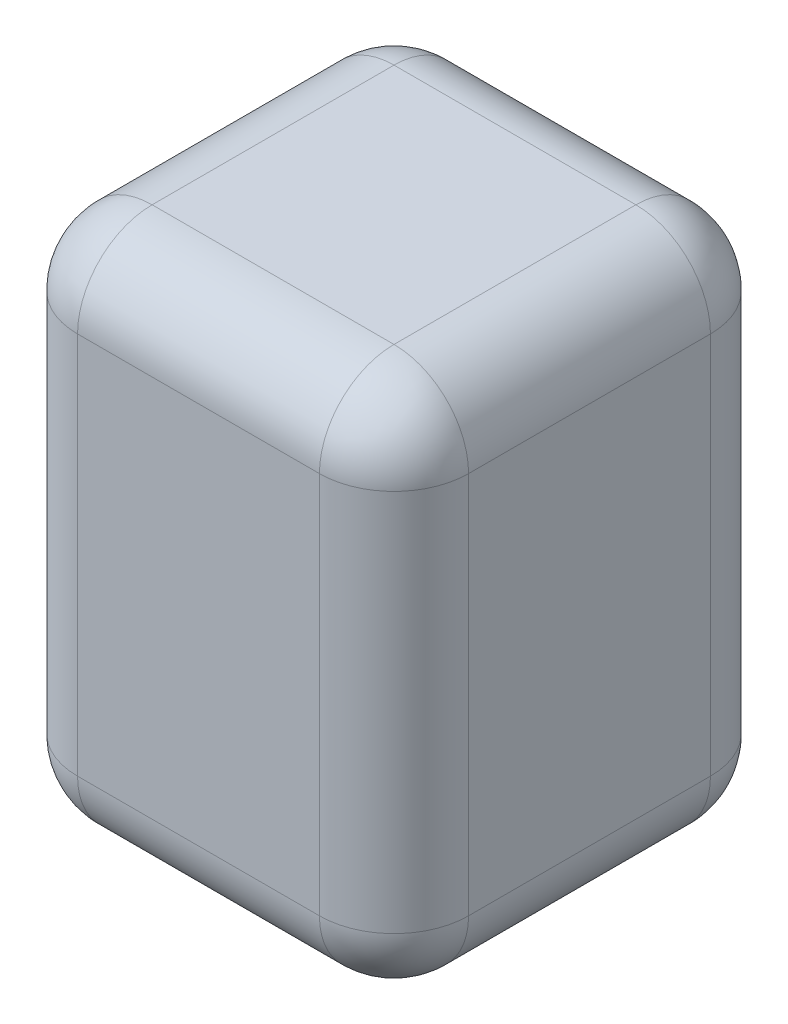
ISO-10303-21;
HEADER;
FILE_DESCRIPTION(('STEP AP214'),'2;1');
FILE_NAME('part.step','',(''),(''),'','','');
FILE_SCHEMA(('AUTOMOTIVE_DESIGN { 1 0 10303 214 1 1 1 1 }'));
ENDSEC;
DATA;
#1=APPLICATION_CONTEXT('core data for automotive mechanical design processes');
#2=APPLICATION_PROTOCOL_DEFINITION('international standard','automotive_design',2000,#1);
#3=PRODUCT_CONTEXT('',#1,'mechanical');
#4=PRODUCT('Part','Part','',(#3));
#5=PRODUCT_RELATED_PRODUCT_CATEGORY('part','',(#4));
#6=PRODUCT_DEFINITION_FORMATION('','',#4);
#7=PRODUCT_DEFINITION_CONTEXT('part definition',#1,'design');
#8=PRODUCT_DEFINITION('design','',#6,#7);
#9=PRODUCT_DEFINITION_SHAPE('','',#8);
#10=(LENGTH_UNIT() NAMED_UNIT(*) SI_UNIT(.MILLI.,.METRE.));
#11=(NAMED_UNIT(*) PLANE_ANGLE_UNIT() SI_UNIT($,.RADIAN.));
#12=(NAMED_UNIT(*) SI_UNIT($,.STERADIAN.) SOLID_ANGLE_UNIT());
#13=UNCERTAINTY_MEASURE_WITH_UNIT(LENGTH_MEASURE(1.E-05),#10,'distance_accuracy_value','');
#14=(GEOMETRIC_REPRESENTATION_CONTEXT(3) GLOBAL_UNCERTAINTY_ASSIGNED_CONTEXT((#13)) GLOBAL_UNIT_ASSIGNED_CONTEXT((#10,
#11,#12)) REPRESENTATION_CONTEXT('',''));
#15=CARTESIAN_POINT('',(0.,0.,0.));
#16=DIRECTION('',(0.,0.,1.));
#17=DIRECTION('',(1.,0.,0.));
#18=AXIS2_PLACEMENT_3D('',#15,#16,#17);
#19=CARTESIAN_POINT('',(-48.5,132.,-48.5));
#20=DIRECTION('',(1.,0.,0.));
#21=DIRECTION('',(0.,0.,-1.));
#22=AXIS2_PLACEMENT_3D('',#19,#20,#21);
#23=PLANE('',#22);
#24=DIRECTION('',(0.,-1.,0.));
#25=VECTOR('',#24,1.);
#26=CARTESIAN_POINT('',(-48.5,132.,-30.));
#27=LINE('',#26,#25);
#28=CARTESIAN_POINT('',(-48.5,113.5,-30.));
#29=VERTEX_POINT('',#28);
#30=CARTESIAN_POINT('',(-48.5,18.5,-30.));
#31=VERTEX_POINT('',#30);
#32=EDGE_CURVE('E176',#29,#31,#27,.T.);
#33=ORIENTED_EDGE('',*,*,#32,.T.);
#34=DIRECTION('',(0.,0.,1.));
#35=VECTOR('',#34,1.);
#36=CARTESIAN_POINT('',(-48.5,18.5,-48.5));
#37=LINE('',#36,#35);
#38=CARTESIAN_POINT('',(-48.5,18.5,30.));
#39=VERTEX_POINT('',#38);
#40=EDGE_CURVE('E185',#31,#39,#37,.T.);
#41=ORIENTED_EDGE('',*,*,#40,.T.);
#42=DIRECTION('',(0.,-1.,0.));
#43=VECTOR('',#42,1.);
#44=CARTESIAN_POINT('',(-48.5,132.,30.));
#45=LINE('',#44,#43);
#46=CARTESIAN_POINT('',(-48.5,113.5,30.));
#47=VERTEX_POINT('',#46);
#48=EDGE_CURVE('E140',#39,#47,#45,.F.);
#49=ORIENTED_EDGE('',*,*,#48,.T.);
#50=DIRECTION('',(0.,0.,1.));
#51=VECTOR('',#50,1.);
#52=CARTESIAN_POINT('',(-48.5,113.5,-48.5));
#53=LINE('',#52,#51);
#54=EDGE_CURVE('E172',#47,#29,#53,.F.);
#55=ORIENTED_EDGE('',*,*,#54,.T.);
#56=EDGE_LOOP('',(#33,#41,#49,#55));
#57=FACE_BOUND('',#56,.T.);
#58=ADVANCED_FACE('F44',(#57),#23,.F.);
#59=CARTESIAN_POINT('',(-48.5,132.,48.5));
#60=DIRECTION('',(0.,0.,-1.));
#61=DIRECTION('',(-1.,0.,0.));
#62=AXIS2_PLACEMENT_3D('',#59,#60,#61);
#63=PLANE('',#62);
#64=DIRECTION('',(1.,0.,0.));
#65=VECTOR('',#64,1.);
#66=CARTESIAN_POINT('',(-48.5,113.5,48.5));
#67=LINE('',#66,#65);
#68=CARTESIAN_POINT('',(30.,113.5,48.5));
#69=VERTEX_POINT('',#68);
#70=CARTESIAN_POINT('',(-30.,113.5,48.5));
#71=VERTEX_POINT('',#70);
#72=EDGE_CURVE('E169',#69,#71,#67,.F.);
#73=ORIENTED_EDGE('',*,*,#72,.T.);
#74=DIRECTION('',(0.,-1.,0.));
#75=VECTOR('',#74,1.);
#76=CARTESIAN_POINT('',(-30.,132.,48.5));
#77=LINE('',#76,#75);
#78=CARTESIAN_POINT('',(-30.,18.5,48.5));
#79=VERTEX_POINT('',#78);
#80=EDGE_CURVE('E138',#71,#79,#77,.T.);
#81=ORIENTED_EDGE('',*,*,#80,.T.);
#82=DIRECTION('',(1.,0.,0.));
#83=VECTOR('',#82,1.);
#84=CARTESIAN_POINT('',(-48.5,18.5,48.5));
#85=LINE('',#84,#83);
#86=CARTESIAN_POINT('',(30.,18.5,48.5));
#87=VERTEX_POINT('',#86);
#88=EDGE_CURVE('E158',#79,#87,#85,.T.);
#89=ORIENTED_EDGE('',*,*,#88,.T.);
#90=DIRECTION('',(0.,-1.,0.));
#91=VECTOR('',#90,1.);
#92=CARTESIAN_POINT('',(30.,132.,48.5));
#93=LINE('',#92,#91);
#94=EDGE_CURVE('E165',#87,#69,#93,.F.);
#95=ORIENTED_EDGE('',*,*,#94,.T.);
#96=EDGE_LOOP('',(#73,#81,#89,#95));
#97=FACE_BOUND('',#96,.T.);
#98=ADVANCED_FACE('F167',(#97),#63,.F.);
#99=CARTESIAN_POINT('',(48.5,132.,-48.5));
#100=DIRECTION('',(-1.,0.,0.));
#101=DIRECTION('',(0.,0.,1.));
#102=AXIS2_PLACEMENT_3D('',#99,#100,#101);
#103=PLANE('',#102);
#104=DIRECTION('',(0.,-1.,0.));
#105=VECTOR('',#104,1.);
#106=CARTESIAN_POINT('',(48.5,132.,30.));
#107=LINE('',#106,#105);
#108=CARTESIAN_POINT('',(48.5,113.5,30.));
#109=VERTEX_POINT('',#108);
#110=CARTESIAN_POINT('',(48.5,18.5,30.));
#111=VERTEX_POINT('',#110);
#112=EDGE_CURVE('E207',#109,#111,#107,.T.);
#113=ORIENTED_EDGE('',*,*,#112,.T.);
#114=DIRECTION('',(0.,0.,-1.));
#115=VECTOR('',#114,1.);
#116=CARTESIAN_POINT('',(48.5,18.5,-48.5));
#117=LINE('',#116,#115);
#118=CARTESIAN_POINT('',(48.5,18.5,-30.));
#119=VERTEX_POINT('',#118);
#120=EDGE_CURVE('E211',#111,#119,#117,.T.);
#121=ORIENTED_EDGE('',*,*,#120,.T.);
#122=DIRECTION('',(0.,-1.,0.));
#123=VECTOR('',#122,1.);
#124=CARTESIAN_POINT('',(48.5,132.,-30.));
#125=LINE('',#124,#123);
#126=CARTESIAN_POINT('',(48.5,113.5,-30.));
#127=VERTEX_POINT('',#126);
#128=EDGE_CURVE('E204',#119,#127,#125,.F.);
#129=ORIENTED_EDGE('',*,*,#128,.T.);
#130=DIRECTION('',(0.,0.,-1.));
#131=VECTOR('',#130,1.);
#132=CARTESIAN_POINT('',(48.5,113.5,48.5));
#133=LINE('',#132,#131);
#134=EDGE_CURVE('E201',#127,#109,#133,.F.);
#135=ORIENTED_EDGE('',*,*,#134,.T.);
#136=EDGE_LOOP('',(#113,#121,#129,#135));
#137=FACE_BOUND('',#136,.T.);
#138=ADVANCED_FACE('F337',(#137),#103,.F.);
#139=CARTESIAN_POINT('',(-48.5,132.,-48.5));
#140=DIRECTION('',(0.,0.,1.));
#141=DIRECTION('',(1.,0.,0.));
#142=AXIS2_PLACEMENT_3D('',#139,#140,#141);
#143=PLANE('',#142);
#144=DIRECTION('',(-1.,0.,0.));
#145=VECTOR('',#144,1.);
#146=CARTESIAN_POINT('',(48.5,113.5,-48.5));
#147=LINE('',#146,#145);
#148=CARTESIAN_POINT('',(-30.,113.5,-48.5));
#149=VERTEX_POINT('',#148);
#150=CARTESIAN_POINT('',(30.,113.5,-48.5));
#151=VERTEX_POINT('',#150);
#152=EDGE_CURVE('E54',#149,#151,#147,.F.);
#153=ORIENTED_EDGE('',*,*,#152,.T.);
#154=DIRECTION('',(0.,-1.,0.));
#155=VECTOR('',#154,1.);
#156=CARTESIAN_POINT('',(30.,132.,-48.5));
#157=LINE('',#156,#155);
#158=CARTESIAN_POINT('',(30.,18.5,-48.5));
#159=VERTEX_POINT('',#158);
#160=EDGE_CURVE('E11',#151,#159,#157,.T.);
#161=ORIENTED_EDGE('',*,*,#160,.T.);
#162=DIRECTION('',(-1.,0.,0.));
#163=VECTOR('',#162,1.);
#164=CARTESIAN_POINT('',(-48.5,18.5,-48.5));
#165=LINE('',#164,#163);
#166=CARTESIAN_POINT('',(-30.,18.5,-48.5));
#167=VERTEX_POINT('',#166);
#168=EDGE_CURVE('E227',#159,#167,#165,.T.);
#169=ORIENTED_EDGE('',*,*,#168,.T.);
#170=DIRECTION('',(0.,-1.,0.));
#171=VECTOR('',#170,1.);
#172=CARTESIAN_POINT('',(-30.,132.,-48.5));
#173=LINE('',#172,#171);
#174=EDGE_CURVE('E65',#167,#149,#173,.F.);
#175=ORIENTED_EDGE('',*,*,#174,.T.);
#176=EDGE_LOOP('',(#153,#161,#169,#175));
#177=FACE_BOUND('',#176,.T.);
#178=ADVANCED_FACE('F349',(#177),#143,.F.);
#179=CARTESIAN_POINT('',(0.,132.,0.));
#180=DIRECTION('',(0.,1.,0.));
#181=DIRECTION('',(0.,0.,1.));
#182=AXIS2_PLACEMENT_3D('',#179,#180,#181);
#183=PLANE('',#182);
#184=DIRECTION('',(1.,0.,0.));
#185=VECTOR('',#184,1.);
#186=CARTESIAN_POINT('',(48.5,132.,30.));
#187=LINE('',#186,#185);
#188=CARTESIAN_POINT('',(-30.,132.,30.));
#189=VERTEX_POINT('',#188);
#190=CARTESIAN_POINT('',(30.,132.,30.));
#191=VERTEX_POINT('',#190);
#192=EDGE_CURVE('E194',#189,#191,#187,.T.);
#193=ORIENTED_EDGE('',*,*,#192,.T.);
#194=DIRECTION('',(0.,0.,-1.));
#195=VECTOR('',#194,1.);
#196=CARTESIAN_POINT('',(30.,132.,-48.5));
#197=LINE('',#196,#195);
#198=CARTESIAN_POINT('',(30.,132.,-30.));
#199=VERTEX_POINT('',#198);
#200=EDGE_CURVE('E198',#191,#199,#197,.T.);
#201=ORIENTED_EDGE('',*,*,#200,.T.);
#202=DIRECTION('',(-1.,0.,0.));
#203=VECTOR('',#202,1.);
#204=CARTESIAN_POINT('',(-48.5,132.,-30.));
#205=LINE('',#204,#203);
#206=CARTESIAN_POINT('',(-30.,132.,-30.));
#207=VERTEX_POINT('',#206);
#208=EDGE_CURVE('E191',#199,#207,#205,.T.);
#209=ORIENTED_EDGE('',*,*,#208,.T.);
#210=DIRECTION('',(0.,0.,1.));
#211=VECTOR('',#210,1.);
#212=CARTESIAN_POINT('',(-30.,132.,48.5));
#213=LINE('',#212,#211);
#214=EDGE_CURVE('E188',#207,#189,#213,.T.);
#215=ORIENTED_EDGE('',*,*,#214,.T.);
#216=EDGE_LOOP('',(#193,#201,#209,#215));
#217=FACE_BOUND('',#216,.T.);
#218=ADVANCED_FACE('F328',(#217),#183,.T.);
#219=CARTESIAN_POINT('',(0.,0.,0.));
#220=DIRECTION('',(0.,1.,0.));
#221=DIRECTION('',(0.,0.,1.));
#222=AXIS2_PLACEMENT_3D('',#219,#220,#221);
#223=PLANE('',#222);
#224=DIRECTION('',(-1.,0.,0.));
#225=VECTOR('',#224,1.);
#226=CARTESIAN_POINT('',(0.,0.,-30.));
#227=LINE('',#226,#225);
#228=CARTESIAN_POINT('',(-30.,0.,-30.));
#229=VERTEX_POINT('',#228);
#230=CARTESIAN_POINT('',(30.,0.,-30.));
#231=VERTEX_POINT('',#230);
#232=EDGE_CURVE('E217',#229,#231,#227,.F.);
#233=ORIENTED_EDGE('',*,*,#232,.T.);
#234=DIRECTION('',(0.,0.,-1.));
#235=VECTOR('',#234,1.);
#236=CARTESIAN_POINT('',(30.,0.,0.));
#237=LINE('',#236,#235);
#238=CARTESIAN_POINT('',(30.,0.,30.));
#239=VERTEX_POINT('',#238);
#240=EDGE_CURVE('E224',#231,#239,#237,.F.);
#241=ORIENTED_EDGE('',*,*,#240,.T.);
#242=DIRECTION('',(1.,0.,0.));
#243=VECTOR('',#242,1.);
#244=CARTESIAN_POINT('',(0.,0.,30.));
#245=LINE('',#244,#243);
#246=CARTESIAN_POINT('',(-30.,0.,30.));
#247=VERTEX_POINT('',#246);
#248=EDGE_CURVE('E220',#239,#247,#245,.F.);
#249=ORIENTED_EDGE('',*,*,#248,.T.);
#250=DIRECTION('',(0.,0.,1.));
#251=VECTOR('',#250,1.);
#252=CARTESIAN_POINT('',(-30.,0.,0.));
#253=LINE('',#252,#251);
#254=EDGE_CURVE('E214',#247,#229,#253,.F.);
#255=ORIENTED_EDGE('',*,*,#254,.T.);
#256=EDGE_LOOP('',(#233,#241,#249,#255));
#257=FACE_BOUND('',#256,.T.);
#258=ADVANCED_FACE('F574',(#257),#223,.F.);
#259=CARTESIAN_POINT('',(30.,132.,-30.));
#260=DIRECTION('',(0.,-1.,0.));
#261=DIRECTION('',(0.,0.,-1.));
#262=AXIS2_PLACEMENT_3D('',#259,#260,#261);
#263=CYLINDRICAL_SURFACE('',#262,18.5);
#264=CARTESIAN_POINT('',(30.,113.5,-30.));
#265=DIRECTION('',(0.,1.,0.));
#266=DIRECTION('',(0.,0.,1.));
#267=AXIS2_PLACEMENT_3D('',#264,#265,#266);
#268=CIRCLE('',#267,18.5);
#269=EDGE_CURVE('E48',#127,#151,#268,.T.);
#270=ORIENTED_EDGE('',*,*,#269,.F.);
#271=ORIENTED_EDGE('',*,*,#128,.F.);
#272=CARTESIAN_POINT('',(30.,18.5,-30.));
#273=DIRECTION('',(0.,-1.,0.));
#274=DIRECTION('',(0.,0.,-1.));
#275=AXIS2_PLACEMENT_3D('',#272,#273,#274);
#276=CIRCLE('',#275,18.5);
#277=EDGE_CURVE('E304',#159,#119,#276,.T.);
#278=ORIENTED_EDGE('',*,*,#277,.F.);
#279=ORIENTED_EDGE('',*,*,#160,.F.);
#280=EDGE_LOOP('',(#270,#271,#278,#279));
#281=FACE_BOUND('',#280,.T.);
#282=ADVANCED_FACE('F46',(#281),#263,.T.);
#283=CARTESIAN_POINT('',(30.,113.5,-30.));
#284=DIRECTION('',(0.,0.,-1.));
#285=DIRECTION('',(-1.,0.,0.));
#286=AXIS2_PLACEMENT_3D('',#283,#284,#285);
#287=SPHERICAL_SURFACE('',#286,18.5);
#288=CARTESIAN_POINT('',(30.,113.5,-30.));
#289=DIRECTION('',(0.,0.,-1.));
#290=DIRECTION('',(-1.,0.,0.));
#291=AXIS2_PLACEMENT_3D('',#288,#289,#290);
#292=CIRCLE('',#291,18.5);
#293=EDGE_CURVE('E297',#127,#199,#292,.F.);
#294=ORIENTED_EDGE('',*,*,#293,.F.);
#295=ORIENTED_EDGE('',*,*,#269,.T.);
#296=CARTESIAN_POINT('',(30.,113.5,-30.));
#297=DIRECTION('',(1.,0.,0.));
#298=DIRECTION('',(0.,1.,0.));
#299=AXIS2_PLACEMENT_3D('',#296,#297,#298);
#300=CIRCLE('',#299,18.5);
#301=EDGE_CURVE('E301',#199,#151,#300,.F.);
#302=ORIENTED_EDGE('',*,*,#301,.F.);
#303=EDGE_LOOP('',(#294,#295,#302));
#304=FACE_BOUND('',#303,.T.);
#305=ADVANCED_FACE('F317',(#304),#287,.T.);
#306=CARTESIAN_POINT('',(30.,18.5,-30.));
#307=DIRECTION('',(1.,0.,0.));
#308=DIRECTION('',(0.,0.,-1.));
#309=AXIS2_PLACEMENT_3D('',#306,#307,#308);
#310=SPHERICAL_SURFACE('',#309,18.5);
#311=CARTESIAN_POINT('',(30.,18.5,-30.));
#312=DIRECTION('',(1.,0.,0.));
#313=DIRECTION('',(0.,0.,-1.));
#314=AXIS2_PLACEMENT_3D('',#311,#312,#313);
#315=CIRCLE('',#314,18.5);
#316=EDGE_CURVE('E289',#159,#231,#315,.F.);
#317=ORIENTED_EDGE('',*,*,#316,.F.);
#318=ORIENTED_EDGE('',*,*,#277,.T.);
#319=CARTESIAN_POINT('',(30.,18.5,-30.));
#320=DIRECTION('',(0.,0.,-1.));
#321=DIRECTION('',(-1.,0.,0.));
#322=AXIS2_PLACEMENT_3D('',#319,#320,#321);
#323=CIRCLE('',#322,18.5);
#324=EDGE_CURVE('E293',#231,#119,#323,.F.);
#325=ORIENTED_EDGE('',*,*,#324,.F.);
#326=EDGE_LOOP('',(#317,#318,#325));
#327=FACE_BOUND('',#326,.T.);
#328=ADVANCED_FACE('F547',(#327),#310,.T.);
#329=CARTESIAN_POINT('',(0.,113.5,-30.));
#330=DIRECTION('',(1.,0.,0.));
#331=DIRECTION('',(0.,0.,-1.));
#332=AXIS2_PLACEMENT_3D('',#329,#330,#331);
#333=CYLINDRICAL_SURFACE('',#332,18.5);
#334=ORIENTED_EDGE('',*,*,#301,.T.);
#335=ORIENTED_EDGE('',*,*,#152,.F.);
#336=CARTESIAN_POINT('',(-30.,113.5,-30.));
#337=DIRECTION('',(-1.,0.,0.));
#338=DIRECTION('',(0.,0.,1.));
#339=AXIS2_PLACEMENT_3D('',#336,#337,#338);
#340=CIRCLE('',#339,18.5);
#341=EDGE_CURVE('E281',#207,#149,#340,.T.);
#342=ORIENTED_EDGE('',*,*,#341,.F.);
#343=ORIENTED_EDGE('',*,*,#208,.F.);
#344=EDGE_LOOP('',(#334,#335,#342,#343));
#345=FACE_BOUND('',#344,.T.);
#346=ADVANCED_FACE('F323',(#345),#333,.T.);
#347=CARTESIAN_POINT('',(30.,113.5,0.));
#348=DIRECTION('',(0.,0.,1.));
#349=DIRECTION('',(1.,0.,0.));
#350=AXIS2_PLACEMENT_3D('',#347,#348,#349);
#351=CYLINDRICAL_SURFACE('',#350,18.5);
#352=ORIENTED_EDGE('',*,*,#293,.T.);
#353=ORIENTED_EDGE('',*,*,#200,.F.);
#354=CARTESIAN_POINT('',(30.,113.5,30.));
#355=DIRECTION('',(0.,0.,1.));
#356=DIRECTION('',(1.,0.,0.));
#357=AXIS2_PLACEMENT_3D('',#354,#355,#356);
#358=CIRCLE('',#357,18.5);
#359=EDGE_CURVE('E277',#109,#191,#358,.T.);
#360=ORIENTED_EDGE('',*,*,#359,.F.);
#361=ORIENTED_EDGE('',*,*,#134,.F.);
#362=EDGE_LOOP('',(#352,#353,#360,#361));
#363=FACE_BOUND('',#362,.T.);
#364=ADVANCED_FACE('F334',(#363),#351,.T.);
#365=CARTESIAN_POINT('',(30.,132.,30.));
#366=DIRECTION('',(0.,-1.,0.));
#367=DIRECTION('',(0.,0.,-1.));
#368=AXIS2_PLACEMENT_3D('',#365,#366,#367);
#369=CYLINDRICAL_SURFACE('',#368,18.5);
#370=CARTESIAN_POINT('',(30.,18.5,30.));
#371=DIRECTION('',(0.,-1.,0.));
#372=DIRECTION('',(0.,0.,-1.));
#373=AXIS2_PLACEMENT_3D('',#370,#371,#372);
#374=CIRCLE('',#373,18.5);
#375=EDGE_CURVE('E269',#111,#87,#374,.T.);
#376=ORIENTED_EDGE('',*,*,#375,.F.);
#377=ORIENTED_EDGE('',*,*,#112,.F.);
#378=CARTESIAN_POINT('',(30.,113.5,30.));
#379=DIRECTION('',(0.,1.,0.));
#380=DIRECTION('',(0.,0.,1.));
#381=AXIS2_PLACEMENT_3D('',#378,#379,#380);
#382=CIRCLE('',#381,18.5);
#383=EDGE_CURVE('E273',#69,#109,#382,.T.);
#384=ORIENTED_EDGE('',*,*,#383,.F.);
#385=ORIENTED_EDGE('',*,*,#94,.F.);
#386=EDGE_LOOP('',(#376,#377,#384,#385));
#387=FACE_BOUND('',#386,.T.);
#388=ADVANCED_FACE('F341',(#387),#369,.T.);
#389=CARTESIAN_POINT('',(30.,18.5,-48.5));
#390=DIRECTION('',(0.,0.,-1.));
#391=DIRECTION('',(-1.,0.,0.));
#392=AXIS2_PLACEMENT_3D('',#389,#390,#391);
#393=CYLINDRICAL_SURFACE('',#392,18.5);
#394=ORIENTED_EDGE('',*,*,#324,.T.);
#395=ORIENTED_EDGE('',*,*,#120,.F.);
#396=CARTESIAN_POINT('',(30.,18.5,30.));
#397=DIRECTION('',(0.,0.,1.));
#398=DIRECTION('',(1.,0.,0.));
#399=AXIS2_PLACEMENT_3D('',#396,#397,#398);
#400=CIRCLE('',#399,18.5);
#401=EDGE_CURVE('E266',#239,#111,#400,.T.);
#402=ORIENTED_EDGE('',*,*,#401,.F.);
#403=ORIENTED_EDGE('',*,*,#240,.F.);
#404=EDGE_LOOP('',(#394,#395,#402,#403));
#405=FACE_BOUND('',#404,.T.);
#406=ADVANCED_FACE('F347',(#405),#393,.T.);
#407=CARTESIAN_POINT('',(-48.5,18.5,-30.));
#408=DIRECTION('',(-1.,0.,0.));
#409=DIRECTION('',(0.,0.,1.));
#410=AXIS2_PLACEMENT_3D('',#407,#408,#409);
#411=CYLINDRICAL_SURFACE('',#410,18.5);
#412=ORIENTED_EDGE('',*,*,#316,.T.);
#413=ORIENTED_EDGE('',*,*,#232,.F.);
#414=CARTESIAN_POINT('',(-30.,18.5,-30.));
#415=DIRECTION('',(-1.,0.,0.));
#416=DIRECTION('',(0.,0.,1.));
#417=AXIS2_PLACEMENT_3D('',#414,#415,#416);
#418=CIRCLE('',#417,18.5);
#419=EDGE_CURVE('E262',#167,#229,#418,.T.);
#420=ORIENTED_EDGE('',*,*,#419,.F.);
#421=ORIENTED_EDGE('',*,*,#168,.F.);
#422=EDGE_LOOP('',(#412,#413,#420,#421));
#423=FACE_BOUND('',#422,.T.);
#424=ADVANCED_FACE('F358',(#423),#411,.T.);
#425=CARTESIAN_POINT('',(-30.,132.,-30.));
#426=DIRECTION('',(0.,-1.,0.));
#427=DIRECTION('',(0.,0.,-1.));
#428=AXIS2_PLACEMENT_3D('',#425,#426,#427);
#429=CYLINDRICAL_SURFACE('',#428,18.5);
#430=CARTESIAN_POINT('',(-30.,113.5,-30.));
#431=DIRECTION('',(0.,1.,0.));
#432=DIRECTION('',(0.,0.,1.));
#433=AXIS2_PLACEMENT_3D('',#430,#431,#432);
#434=CIRCLE('',#433,18.5);
#435=EDGE_CURVE('E285',#149,#29,#434,.T.);
#436=ORIENTED_EDGE('',*,*,#435,.F.);
#437=ORIENTED_EDGE('',*,*,#174,.F.);
#438=CARTESIAN_POINT('',(-30.,18.5,-30.));
#439=DIRECTION('',(0.,-1.,0.));
#440=DIRECTION('',(0.,0.,-1.));
#441=AXIS2_PLACEMENT_3D('',#438,#439,#440);
#442=CIRCLE('',#441,18.5);
#443=EDGE_CURVE('E258',#31,#167,#442,.T.);
#444=ORIENTED_EDGE('',*,*,#443,.F.);
#445=ORIENTED_EDGE('',*,*,#32,.F.);
#446=EDGE_LOOP('',(#436,#437,#444,#445));
#447=FACE_BOUND('',#446,.T.);
#448=ADVANCED_FACE('F354',(#447),#429,.T.);
#449=CARTESIAN_POINT('',(-30.,113.5,-30.));
#450=DIRECTION('',(0.,0.,-1.));
#451=DIRECTION('',(-1.,0.,0.));
#452=AXIS2_PLACEMENT_3D('',#449,#450,#451);
#453=SPHERICAL_SURFACE('',#452,18.5);
#454=ORIENTED_EDGE('',*,*,#341,.T.);
#455=ORIENTED_EDGE('',*,*,#435,.T.);
#456=CARTESIAN_POINT('',(-30.,113.5,-30.));
#457=DIRECTION('',(0.,0.,-1.));
#458=DIRECTION('',(-1.,0.,0.));
#459=AXIS2_PLACEMENT_3D('',#456,#457,#458);
#460=CIRCLE('',#459,18.5);
#461=EDGE_CURVE('E254',#207,#29,#460,.F.);
#462=ORIENTED_EDGE('',*,*,#461,.F.);
#463=EDGE_LOOP('',(#454,#455,#462));
#464=FACE_BOUND('',#463,.T.);
#465=ADVANCED_FACE('F367',(#464),#453,.T.);
#466=CARTESIAN_POINT('',(30.,113.5,30.));
#467=DIRECTION('',(1.,0.,0.));
#468=DIRECTION('',(0.,0.,-1.));
#469=AXIS2_PLACEMENT_3D('',#466,#467,#468);
#470=SPHERICAL_SURFACE('',#469,18.5);
#471=ORIENTED_EDGE('',*,*,#383,.T.);
#472=ORIENTED_EDGE('',*,*,#359,.T.);
#473=CARTESIAN_POINT('',(30.,113.5,30.));
#474=DIRECTION('',(1.,0.,0.));
#475=DIRECTION('',(0.,0.,-1.));
#476=AXIS2_PLACEMENT_3D('',#473,#474,#475);
#477=CIRCLE('',#476,18.5);
#478=EDGE_CURVE('E251',#69,#191,#477,.F.);
#479=ORIENTED_EDGE('',*,*,#478,.F.);
#480=EDGE_LOOP('',(#471,#472,#479));
#481=FACE_BOUND('',#480,.T.);
#482=ADVANCED_FACE('F377',(#481),#470,.T.);
#483=CARTESIAN_POINT('',(30.,18.5,30.));
#484=DIRECTION('',(1.,0.,0.));
#485=DIRECTION('',(0.,0.,-1.));
#486=AXIS2_PLACEMENT_3D('',#483,#484,#485);
#487=SPHERICAL_SURFACE('',#486,18.5);
#488=ORIENTED_EDGE('',*,*,#401,.T.);
#489=ORIENTED_EDGE('',*,*,#375,.T.);
#490=CARTESIAN_POINT('',(30.,18.5,30.));
#491=DIRECTION('',(1.,0.,0.));
#492=DIRECTION('',(0.,0.,-1.));
#493=AXIS2_PLACEMENT_3D('',#490,#491,#492);
#494=CIRCLE('',#493,18.5);
#495=EDGE_CURVE('E161',#239,#87,#494,.F.);
#496=ORIENTED_EDGE('',*,*,#495,.F.);
#497=EDGE_LOOP('',(#488,#489,#496));
#498=FACE_BOUND('',#497,.T.);
#499=ADVANCED_FACE('F379',(#498),#487,.T.);
#500=CARTESIAN_POINT('',(-30.,18.5,-30.));
#501=DIRECTION('',(0.,0.,-1.));
#502=DIRECTION('',(0.,1.,0.));
#503=AXIS2_PLACEMENT_3D('',#500,#501,#502);
#504=SPHERICAL_SURFACE('',#503,18.5);
#505=ORIENTED_EDGE('',*,*,#443,.T.);
#506=ORIENTED_EDGE('',*,*,#419,.T.);
#507=CARTESIAN_POINT('',(-30.,18.5,-30.));
#508=DIRECTION('',(0.,0.,-1.));
#509=DIRECTION('',(-1.,0.,0.));
#510=AXIS2_PLACEMENT_3D('',#507,#508,#509);
#511=CIRCLE('',#510,18.5);
#512=EDGE_CURVE('E245',#31,#229,#511,.F.);
#513=ORIENTED_EDGE('',*,*,#512,.F.);
#514=EDGE_LOOP('',(#505,#506,#513));
#515=FACE_BOUND('',#514,.T.);
#516=ADVANCED_FACE('F360',(#515),#504,.T.);
#517=CARTESIAN_POINT('',(-30.,113.5,0.));
#518=DIRECTION('',(0.,0.,-1.));
#519=DIRECTION('',(-1.,0.,0.));
#520=AXIS2_PLACEMENT_3D('',#517,#518,#519);
#521=CYLINDRICAL_SURFACE('',#520,18.5);
#522=ORIENTED_EDGE('',*,*,#461,.T.);
#523=ORIENTED_EDGE('',*,*,#54,.F.);
#524=CARTESIAN_POINT('',(-30.,113.5,30.));
#525=DIRECTION('',(0.,0.,1.));
#526=DIRECTION('',(1.,0.,0.));
#527=AXIS2_PLACEMENT_3D('',#524,#525,#526);
#528=CIRCLE('',#527,18.5);
#529=EDGE_CURVE('E241',#189,#47,#528,.T.);
#530=ORIENTED_EDGE('',*,*,#529,.F.);
#531=ORIENTED_EDGE('',*,*,#214,.F.);
#532=EDGE_LOOP('',(#522,#523,#530,#531));
#533=FACE_BOUND('',#532,.T.);
#534=ADVANCED_FACE('F369',(#533),#521,.T.);
#535=CARTESIAN_POINT('',(0.,113.5,30.));
#536=DIRECTION('',(-1.,0.,0.));
#537=DIRECTION('',(0.,0.,1.));
#538=AXIS2_PLACEMENT_3D('',#535,#536,#537);
#539=CYLINDRICAL_SURFACE('',#538,18.5);
#540=ORIENTED_EDGE('',*,*,#478,.T.);
#541=ORIENTED_EDGE('',*,*,#192,.F.);
#542=CARTESIAN_POINT('',(-30.,113.5,30.));
#543=DIRECTION('',(-1.,0.,0.));
#544=DIRECTION('',(0.,0.,1.));
#545=AXIS2_PLACEMENT_3D('',#542,#543,#544);
#546=CIRCLE('',#545,18.5);
#547=EDGE_CURVE('E155',#71,#189,#546,.T.);
#548=ORIENTED_EDGE('',*,*,#547,.F.);
#549=ORIENTED_EDGE('',*,*,#72,.F.);
#550=EDGE_LOOP('',(#540,#541,#548,#549));
#551=FACE_BOUND('',#550,.T.);
#552=ADVANCED_FACE('F375',(#551),#539,.T.);
#553=CARTESIAN_POINT('',(-48.5,18.5,30.));
#554=DIRECTION('',(1.,0.,0.));
#555=DIRECTION('',(0.,0.,-1.));
#556=AXIS2_PLACEMENT_3D('',#553,#554,#555);
#557=CYLINDRICAL_SURFACE('',#556,18.5);
#558=ORIENTED_EDGE('',*,*,#495,.T.);
#559=ORIENTED_EDGE('',*,*,#88,.F.);
#560=CARTESIAN_POINT('',(-30.,18.5,30.));
#561=DIRECTION('',(-1.,0.,0.));
#562=DIRECTION('',(0.,0.,1.));
#563=AXIS2_PLACEMENT_3D('',#560,#561,#562);
#564=CIRCLE('',#563,18.5);
#565=EDGE_CURVE('E146',#247,#79,#564,.T.);
#566=ORIENTED_EDGE('',*,*,#565,.F.);
#567=ORIENTED_EDGE('',*,*,#248,.F.);
#568=EDGE_LOOP('',(#558,#559,#566,#567));
#569=FACE_BOUND('',#568,.T.);
#570=ADVANCED_FACE('F159',(#569),#557,.T.);
#571=CARTESIAN_POINT('',(-30.,18.5,-48.5));
#572=DIRECTION('',(0.,0.,1.));
#573=DIRECTION('',(1.,0.,0.));
#574=AXIS2_PLACEMENT_3D('',#571,#572,#573);
#575=CYLINDRICAL_SURFACE('',#574,18.5);
#576=ORIENTED_EDGE('',*,*,#512,.T.);
#577=ORIENTED_EDGE('',*,*,#254,.F.);
#578=CARTESIAN_POINT('',(-30.,18.5,30.));
#579=DIRECTION('',(0.,0.,1.));
#580=DIRECTION('',(1.,0.,0.));
#581=AXIS2_PLACEMENT_3D('',#578,#579,#580);
#582=CIRCLE('',#581,18.5);
#583=EDGE_CURVE('E150',#39,#247,#582,.T.);
#584=ORIENTED_EDGE('',*,*,#583,.F.);
#585=ORIENTED_EDGE('',*,*,#40,.F.);
#586=EDGE_LOOP('',(#576,#577,#584,#585));
#587=FACE_BOUND('',#586,.T.);
#588=ADVANCED_FACE('F363',(#587),#575,.T.);
#589=CARTESIAN_POINT('',(-30.,113.5,30.));
#590=DIRECTION('',(0.,1.,0.));
#591=DIRECTION('',(0.,0.,1.));
#592=AXIS2_PLACEMENT_3D('',#589,#590,#591);
#593=SPHERICAL_SURFACE('',#592,18.5);
#594=ORIENTED_EDGE('',*,*,#547,.T.);
#595=ORIENTED_EDGE('',*,*,#529,.T.);
#596=CARTESIAN_POINT('',(-30.,113.5,30.));
#597=DIRECTION('',(0.,1.,0.));
#598=DIRECTION('',(0.,0.,1.));
#599=AXIS2_PLACEMENT_3D('',#596,#597,#598);
#600=CIRCLE('',#599,18.5);
#601=EDGE_CURVE('E143',#71,#47,#600,.F.);
#602=ORIENTED_EDGE('',*,*,#601,.F.);
#603=EDGE_LOOP('',(#594,#595,#602));
#604=FACE_BOUND('',#603,.T.);
#605=ADVANCED_FACE('F373',(#604),#593,.T.);
#606=CARTESIAN_POINT('',(-30.,18.5,30.));
#607=DIRECTION('',(0.,-1.,0.));
#608=DIRECTION('',(0.,0.,-1.));
#609=AXIS2_PLACEMENT_3D('',#606,#607,#608);
#610=SPHERICAL_SURFACE('',#609,18.5);
#611=ORIENTED_EDGE('',*,*,#583,.T.);
#612=ORIENTED_EDGE('',*,*,#565,.T.);
#613=CARTESIAN_POINT('',(-30.,18.5,30.));
#614=DIRECTION('',(0.,-1.,0.));
#615=DIRECTION('',(0.,0.,-1.));
#616=AXIS2_PLACEMENT_3D('',#613,#614,#615);
#617=CIRCLE('',#616,18.5);
#618=EDGE_CURVE('E134',#39,#79,#617,.F.);
#619=ORIENTED_EDGE('',*,*,#618,.F.);
#620=EDGE_LOOP('',(#611,#612,#619));
#621=FACE_BOUND('',#620,.T.);
#622=ADVANCED_FACE('F148',(#621),#610,.T.);
#623=CARTESIAN_POINT('',(-30.,132.,30.));
#624=DIRECTION('',(0.,-1.,0.));
#625=DIRECTION('',(0.,0.,-1.));
#626=AXIS2_PLACEMENT_3D('',#623,#624,#625);
#627=CYLINDRICAL_SURFACE('',#626,18.5);
#628=ORIENTED_EDGE('',*,*,#601,.T.);
#629=ORIENTED_EDGE('',*,*,#48,.F.);
#630=ORIENTED_EDGE('',*,*,#618,.T.);
#631=ORIENTED_EDGE('',*,*,#80,.F.);
#632=EDGE_LOOP('',(#628,#629,#630,#631));
#633=FACE_BOUND('',#632,.T.);
#634=ADVANCED_FACE('F136',(#633),#627,.T.);
#635=CLOSED_SHELL('',(#58,#98,#138,#178,#218,#258,#282,#305,#328,#346,#364,#388,#406,#424,#448,
#465,#482,#499,#516,#534,#552,#570,#588,#605,#622,#634));
#636=MANIFOLD_SOLID_BREP('B2',#635);
#637=ADVANCED_BREP_SHAPE_REPRESENTATION('',(#18,#636),#14);
#638=SHAPE_DEFINITION_REPRESENTATION(#9,#637);
ENDSEC;
END-ISO-10303-21;
